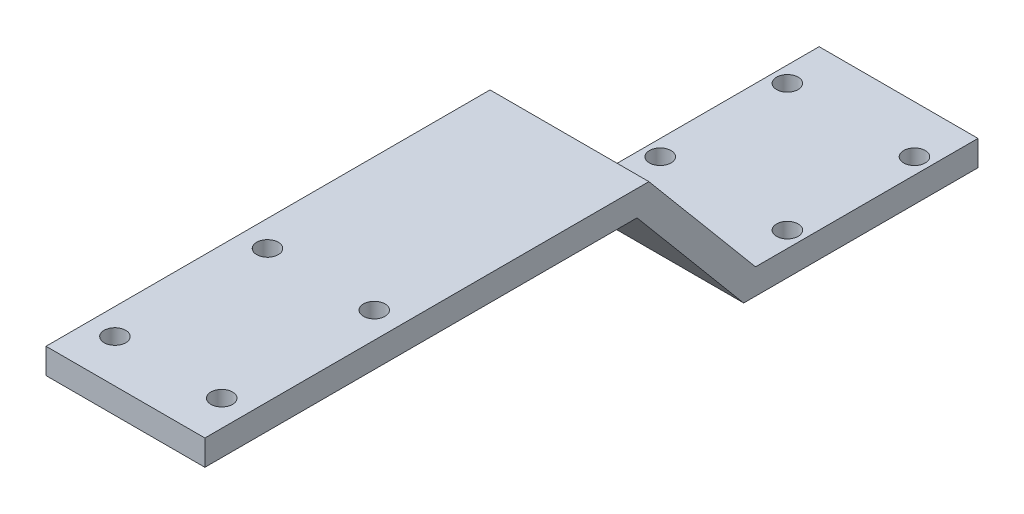
ISO-10303-21;
HEADER;
FILE_DESCRIPTION(('STEP AP214'),'2;1');
FILE_NAME('part.step','',(''),(''),'','','');
FILE_SCHEMA(('AUTOMOTIVE_DESIGN { 1 0 10303 214 1 1 1 1 }'));
ENDSEC;
DATA;
#1=APPLICATION_CONTEXT('core data for automotive mechanical design processes');
#2=APPLICATION_PROTOCOL_DEFINITION('international standard','automotive_design',2000,#1);
#3=PRODUCT_CONTEXT('',#1,'mechanical');
#4=PRODUCT('Part','Part','',(#3));
#5=PRODUCT_RELATED_PRODUCT_CATEGORY('part','',(#4));
#6=PRODUCT_DEFINITION_FORMATION('','',#4);
#7=PRODUCT_DEFINITION_CONTEXT('part definition',#1,'design');
#8=PRODUCT_DEFINITION('design','',#6,#7);
#9=PRODUCT_DEFINITION_SHAPE('','',#8);
#10=(LENGTH_UNIT() NAMED_UNIT(*) SI_UNIT(.MILLI.,.METRE.));
#11=(NAMED_UNIT(*) PLANE_ANGLE_UNIT() SI_UNIT($,.RADIAN.));
#12=(NAMED_UNIT(*) SI_UNIT($,.STERADIAN.) SOLID_ANGLE_UNIT());
#13=UNCERTAINTY_MEASURE_WITH_UNIT(LENGTH_MEASURE(1.E-05),#10,'distance_accuracy_value','');
#14=(GEOMETRIC_REPRESENTATION_CONTEXT(3) GLOBAL_UNCERTAINTY_ASSIGNED_CONTEXT((#13)) GLOBAL_UNIT_ASSIGNED_CONTEXT((#10,
#11,#12)) REPRESENTATION_CONTEXT('',''));
#15=CARTESIAN_POINT('',(0.,0.,0.));
#16=DIRECTION('',(0.,0.,1.));
#17=DIRECTION('',(1.,0.,0.));
#18=AXIS2_PLACEMENT_3D('',#15,#16,#17);
#19=CARTESIAN_POINT('',(12.5,0.,0.));
#20=DIRECTION('',(0.,1.,0.));
#21=DIRECTION('',(0.,0.,1.));
#22=AXIS2_PLACEMENT_3D('',#19,#20,#21);
#23=PLANE('',#22);
#24=CARTESIAN_POINT('',(-10.,0.,27.5));
#25=DIRECTION('',(0.,1.,0.));
#26=DIRECTION('',(0.,0.,1.));
#27=AXIS2_PLACEMENT_3D('',#24,#25,#26);
#28=CIRCLE('',#27,1.69999999999999);
#29=CARTESIAN_POINT('',(-10.,0.,29.2));
#30=VERTEX_POINT('',#29);
#31=EDGE_CURVE('E218',#30,#30,#28,.T.);
#32=ORIENTED_EDGE('',*,*,#31,.T.);
#33=EDGE_LOOP('',(#32));
#34=FACE_BOUND('',#33,.T.);
#35=CARTESIAN_POINT('',(10.,0.,27.5));
#36=DIRECTION('',(0.,1.,0.));
#37=DIRECTION('',(0.,0.,1.));
#38=AXIS2_PLACEMENT_3D('',#35,#36,#37);
#39=CIRCLE('',#38,1.69999999999999);
#40=CARTESIAN_POINT('',(10.,0.,29.2));
#41=VERTEX_POINT('',#40);
#42=EDGE_CURVE('E212',#41,#41,#39,.T.);
#43=ORIENTED_EDGE('',*,*,#42,.T.);
#44=EDGE_LOOP('',(#43));
#45=FACE_BOUND('',#44,.T.);
#46=CARTESIAN_POINT('',(10.,0.,7.5));
#47=DIRECTION('',(0.,1.,0.));
#48=DIRECTION('',(0.,0.,1.));
#49=AXIS2_PLACEMENT_3D('',#46,#47,#48);
#50=CIRCLE('',#49,1.69999999999999);
#51=CARTESIAN_POINT('',(10.,0.,9.19999999999999));
#52=VERTEX_POINT('',#51);
#53=EDGE_CURVE('E206',#52,#52,#50,.T.);
#54=ORIENTED_EDGE('',*,*,#53,.T.);
#55=EDGE_LOOP('',(#54));
#56=FACE_BOUND('',#55,.T.);
#57=CARTESIAN_POINT('',(-10.,0.,7.5));
#58=DIRECTION('',(0.,1.,0.));
#59=DIRECTION('',(0.,0.,1.));
#60=AXIS2_PLACEMENT_3D('',#57,#58,#59);
#61=CIRCLE('',#60,1.69999999999999);
#62=CARTESIAN_POINT('',(-10.,0.,9.19999999999999));
#63=VERTEX_POINT('',#62);
#64=EDGE_CURVE('E200',#63,#63,#61,.T.);
#65=ORIENTED_EDGE('',*,*,#64,.T.);
#66=EDGE_LOOP('',(#65));
#67=FACE_BOUND('',#66,.T.);
#68=DIRECTION('',(0.,0.,-1.));
#69=VECTOR('',#68,1.);
#70=CARTESIAN_POINT('',(-12.5,0.,0.));
#71=LINE('',#70,#69);
#72=CARTESIAN_POINT('',(-12.5,0.,36.86523063262));
#73=VERTEX_POINT('',#72);
#74=CARTESIAN_POINT('',(-12.5,0.,0.));
#75=VERTEX_POINT('',#74);
#76=EDGE_CURVE('E129',#73,#75,#71,.T.);
#77=ORIENTED_EDGE('',*,*,#76,.T.);
#78=DIRECTION('',(-1.,0.,0.));
#79=VECTOR('',#78,1.);
#80=CARTESIAN_POINT('',(12.5,0.,0.));
#81=LINE('',#80,#79);
#82=CARTESIAN_POINT('',(12.5,0.,0.));
#83=VERTEX_POINT('',#82);
#84=EDGE_CURVE('E11',#83,#75,#81,.T.);
#85=ORIENTED_EDGE('',*,*,#84,.F.);
#86=DIRECTION('',(0.,0.,-1.));
#87=VECTOR('',#86,1.);
#88=CARTESIAN_POINT('',(12.5,0.,0.));
#89=LINE('',#88,#87);
#90=CARTESIAN_POINT('',(12.5,0.,36.86523063262));
#91=VERTEX_POINT('',#90);
#92=EDGE_CURVE('E144',#91,#83,#89,.T.);
#93=ORIENTED_EDGE('',*,*,#92,.F.);
#94=DIRECTION('',(-1.,0.,0.));
#95=VECTOR('',#94,1.);
#96=CARTESIAN_POINT('',(12.5,0.,36.86523063262));
#97=LINE('',#96,#95);
#98=EDGE_CURVE('E125',#91,#73,#97,.T.);
#99=ORIENTED_EDGE('',*,*,#98,.T.);
#100=EDGE_LOOP('',(#77,#85,#93,#99));
#101=FACE_BOUND('',#100,.T.);
#102=ADVANCED_FACE('F33',(#34,#45,#56,#67,#101),#23,.F.);
#103=CARTESIAN_POINT('',(12.5,0.,0.));
#104=DIRECTION('',(0.,0.,1.));
#105=DIRECTION('',(1.,0.,0.));
#106=AXIS2_PLACEMENT_3D('',#103,#104,#105);
#107=PLANE('',#106);
#108=DIRECTION('',(0.,1.,0.));
#109=VECTOR('',#108,1.);
#110=CARTESIAN_POINT('',(-12.5,0.,0.));
#111=LINE('',#110,#109);
#112=CARTESIAN_POINT('',(-12.5,4.,0.));
#113=VERTEX_POINT('',#112);
#114=EDGE_CURVE('E132',#75,#113,#111,.T.);
#115=ORIENTED_EDGE('',*,*,#114,.T.);
#116=DIRECTION('',(-1.,0.,0.));
#117=VECTOR('',#116,1.);
#118=CARTESIAN_POINT('',(12.5,4.,0.));
#119=LINE('',#118,#117);
#120=CARTESIAN_POINT('',(12.5,4.,0.));
#121=VERTEX_POINT('',#120);
#122=EDGE_CURVE('E41',#121,#113,#119,.T.);
#123=ORIENTED_EDGE('',*,*,#122,.F.);
#124=DIRECTION('',(0.,1.,0.));
#125=VECTOR('',#124,1.);
#126=CARTESIAN_POINT('',(12.5,0.,0.));
#127=LINE('',#126,#125);
#128=EDGE_CURVE('E92',#83,#121,#127,.T.);
#129=ORIENTED_EDGE('',*,*,#128,.F.);
#130=ORIENTED_EDGE('',*,*,#84,.T.);
#131=EDGE_LOOP('',(#115,#123,#129,#130));
#132=FACE_BOUND('',#131,.T.);
#133=ADVANCED_FACE('F230',(#132),#107,.F.);
#134=CARTESIAN_POINT('',(12.5,4.,0.));
#135=DIRECTION('',(0.,-1.,0.));
#136=DIRECTION('',(0.,0.,-1.));
#137=AXIS2_PLACEMENT_3D('',#134,#135,#136);
#138=PLANE('',#137);
#139=CARTESIAN_POINT('',(-10.,4.,27.5));
#140=DIRECTION('',(0.,1.,0.));
#141=DIRECTION('',(0.,0.,1.));
#142=AXIS2_PLACEMENT_3D('',#139,#140,#141);
#143=CIRCLE('',#142,1.69999999999999);
#144=CARTESIAN_POINT('',(-10.,4.,29.2));
#145=VERTEX_POINT('',#144);
#146=EDGE_CURVE('E221',#145,#145,#143,.T.);
#147=ORIENTED_EDGE('',*,*,#146,.F.);
#148=EDGE_LOOP('',(#147));
#149=FACE_BOUND('',#148,.T.);
#150=CARTESIAN_POINT('',(10.,4.,27.5));
#151=DIRECTION('',(0.,1.,0.));
#152=DIRECTION('',(0.,0.,1.));
#153=AXIS2_PLACEMENT_3D('',#150,#151,#152);
#154=CIRCLE('',#153,1.69999999999999);
#155=CARTESIAN_POINT('',(10.,4.,29.2));
#156=VERTEX_POINT('',#155);
#157=EDGE_CURVE('E215',#156,#156,#154,.T.);
#158=ORIENTED_EDGE('',*,*,#157,.F.);
#159=EDGE_LOOP('',(#158));
#160=FACE_BOUND('',#159,.T.);
#161=CARTESIAN_POINT('',(10.,4.,7.5));
#162=DIRECTION('',(0.,1.,0.));
#163=DIRECTION('',(0.,0.,1.));
#164=AXIS2_PLACEMENT_3D('',#161,#162,#163);
#165=CIRCLE('',#164,1.69999999999999);
#166=CARTESIAN_POINT('',(10.,4.,9.19999999999999));
#167=VERTEX_POINT('',#166);
#168=EDGE_CURVE('E209',#167,#167,#165,.T.);
#169=ORIENTED_EDGE('',*,*,#168,.F.);
#170=EDGE_LOOP('',(#169));
#171=FACE_BOUND('',#170,.T.);
#172=CARTESIAN_POINT('',(-10.,4.,7.5));
#173=DIRECTION('',(0.,1.,0.));
#174=DIRECTION('',(0.,0.,1.));
#175=AXIS2_PLACEMENT_3D('',#172,#173,#174);
#176=CIRCLE('',#175,1.69999999999999);
#177=CARTESIAN_POINT('',(-10.,4.,9.19999999999999));
#178=VERTEX_POINT('',#177);
#179=EDGE_CURVE('E203',#178,#178,#176,.T.);
#180=ORIENTED_EDGE('',*,*,#179,.F.);
#181=EDGE_LOOP('',(#180));
#182=FACE_BOUND('',#181,.T.);
#183=DIRECTION('',(0.,0.,1.));
#184=VECTOR('',#183,1.);
#185=CARTESIAN_POINT('',(-12.5,4.,0.));
#186=LINE('',#185,#184);
#187=CARTESIAN_POINT('',(-12.5,4.,35.));
#188=VERTEX_POINT('',#187);
#189=EDGE_CURVE('E135',#113,#188,#186,.T.);
#190=ORIENTED_EDGE('',*,*,#189,.T.);
#191=DIRECTION('',(-1.,0.,0.));
#192=VECTOR('',#191,1.);
#193=CARTESIAN_POINT('',(12.5,4.,35.));
#194=LINE('',#193,#192);
#195=CARTESIAN_POINT('',(12.5,4.,35.));
#196=VERTEX_POINT('',#195);
#197=EDGE_CURVE('E151',#196,#188,#194,.T.);
#198=ORIENTED_EDGE('',*,*,#197,.F.);
#199=DIRECTION('',(0.,0.,1.));
#200=VECTOR('',#199,1.);
#201=CARTESIAN_POINT('',(12.5,4.,0.));
#202=LINE('',#201,#200);
#203=EDGE_CURVE('E159',#121,#196,#202,.T.);
#204=ORIENTED_EDGE('',*,*,#203,.F.);
#205=ORIENTED_EDGE('',*,*,#122,.T.);
#206=EDGE_LOOP('',(#190,#198,#204,#205));
#207=FACE_BOUND('',#206,.T.);
#208=ADVANCED_FACE('F157',(#149,#160,#171,#182,#207),#138,.F.);
#209=CARTESIAN_POINT('',(12.5,4.,35.));
#210=DIRECTION('',(0.,-0.642787609686538,0.766044443118979));
#211=DIRECTION('',(0.,-0.766044443118979,-0.642787609686538));
#212=AXIS2_PLACEMENT_3D('',#209,#210,#211);
#213=PLANE('',#212);
#214=DIRECTION('',(0.,0.766044443118979,0.642787609686538));
#215=VECTOR('',#214,1.);
#216=CARTESIAN_POINT('',(-12.5,4.,35.));
#217=LINE('',#216,#215);
#218=CARTESIAN_POINT('',(-12.5,24.,51.7819926235455));
#219=VERTEX_POINT('',#218);
#220=EDGE_CURVE('E137',#188,#219,#217,.T.);
#221=ORIENTED_EDGE('',*,*,#220,.T.);
#222=DIRECTION('',(-1.,0.,0.));
#223=VECTOR('',#222,1.);
#224=CARTESIAN_POINT('',(12.5,24.,51.7819926235455));
#225=LINE('',#224,#223);
#226=CARTESIAN_POINT('',(12.5,24.,51.7819926235455));
#227=VERTEX_POINT('',#226);
#228=EDGE_CURVE('E148',#227,#219,#225,.T.);
#229=ORIENTED_EDGE('',*,*,#228,.F.);
#230=DIRECTION('',(0.,0.766044443118979,0.642787609686538));
#231=VECTOR('',#230,1.);
#232=CARTESIAN_POINT('',(12.5,4.,35.));
#233=LINE('',#232,#231);
#234=EDGE_CURVE('E171',#196,#227,#233,.T.);
#235=ORIENTED_EDGE('',*,*,#234,.F.);
#236=ORIENTED_EDGE('',*,*,#197,.T.);
#237=EDGE_LOOP('',(#221,#229,#235,#236));
#238=FACE_BOUND('',#237,.T.);
#239=ADVANCED_FACE('F167',(#238),#213,.F.);
#240=CARTESIAN_POINT('',(12.5,24.,51.7819926235455));
#241=DIRECTION('',(0.,-1.,0.));
#242=DIRECTION('',(0.,0.,-1.));
#243=AXIS2_PLACEMENT_3D('',#240,#241,#242);
#244=PLANE('',#243);
#245=CARTESIAN_POINT('',(-8.4,24.,90.8972232561655));
#246=DIRECTION('',(0.,1.,0.));
#247=DIRECTION('',(0.,0.,1.));
#248=AXIS2_PLACEMENT_3D('',#245,#246,#247);
#249=CIRCLE('',#248,1.69999999999999);
#250=CARTESIAN_POINT('',(-8.4,24.,92.5972232561655));
#251=VERTEX_POINT('',#250);
#252=EDGE_CURVE('E197',#251,#251,#249,.T.);
#253=ORIENTED_EDGE('',*,*,#252,.F.);
#254=EDGE_LOOP('',(#253));
#255=FACE_BOUND('',#254,.T.);
#256=CARTESIAN_POINT('',(-8.4,24.,114.897223256166));
#257=DIRECTION('',(0.,1.,0.));
#258=DIRECTION('',(0.,0.,1.));
#259=AXIS2_PLACEMENT_3D('',#256,#257,#258);
#260=CIRCLE('',#259,1.69999999999999);
#261=CARTESIAN_POINT('',(-8.4,24.,116.597223256166));
#262=VERTEX_POINT('',#261);
#263=EDGE_CURVE('E191',#262,#262,#260,.T.);
#264=ORIENTED_EDGE('',*,*,#263,.F.);
#265=EDGE_LOOP('',(#264));
#266=FACE_BOUND('',#265,.T.);
#267=CARTESIAN_POINT('',(8.4,24.,114.897223256166));
#268=DIRECTION('',(0.,1.,0.));
#269=DIRECTION('',(0.,0.,1.));
#270=AXIS2_PLACEMENT_3D('',#267,#268,#269);
#271=CIRCLE('',#270,1.69999999999999);
#272=CARTESIAN_POINT('',(8.4,24.,116.597223256166));
#273=VERTEX_POINT('',#272);
#274=EDGE_CURVE('E185',#273,#273,#271,.T.);
#275=ORIENTED_EDGE('',*,*,#274,.F.);
#276=EDGE_LOOP('',(#275));
#277=FACE_BOUND('',#276,.T.);
#278=CARTESIAN_POINT('',(8.4,24.,90.8972232561656));
#279=DIRECTION('',(0.,1.,0.));
#280=DIRECTION('',(0.,0.,1.));
#281=AXIS2_PLACEMENT_3D('',#278,#279,#280);
#282=CIRCLE('',#281,1.69999999999999);
#283=CARTESIAN_POINT('',(8.4,24.,92.5972232561655));
#284=VERTEX_POINT('',#283);
#285=EDGE_CURVE('E179',#284,#284,#282,.T.);
#286=ORIENTED_EDGE('',*,*,#285,.F.);
#287=EDGE_LOOP('',(#286));
#288=FACE_BOUND('',#287,.T.);
#289=DIRECTION('',(0.,0.,1.));
#290=VECTOR('',#289,1.);
#291=CARTESIAN_POINT('',(-12.5,24.,51.7819926235455));
#292=LINE('',#291,#290);
#293=CARTESIAN_POINT('',(-12.5,24.,121.647223256166));
#294=VERTEX_POINT('',#293);
#295=EDGE_CURVE('E139',#219,#294,#292,.T.);
#296=ORIENTED_EDGE('',*,*,#295,.T.);
#297=DIRECTION('',(-1.,0.,0.));
#298=VECTOR('',#297,1.);
#299=CARTESIAN_POINT('',(12.5,24.,121.647223256166));
#300=LINE('',#299,#298);
#301=CARTESIAN_POINT('',(12.5,24.,121.647223256166));
#302=VERTEX_POINT('',#301);
#303=EDGE_CURVE('E120',#302,#294,#300,.T.);
#304=ORIENTED_EDGE('',*,*,#303,.F.);
#305=DIRECTION('',(0.,0.,1.));
#306=VECTOR('',#305,1.);
#307=CARTESIAN_POINT('',(12.5,24.,51.7819926235455));
#308=LINE('',#307,#306);
#309=EDGE_CURVE('E111',#227,#302,#308,.T.);
#310=ORIENTED_EDGE('',*,*,#309,.F.);
#311=ORIENTED_EDGE('',*,*,#228,.T.);
#312=EDGE_LOOP('',(#296,#304,#310,#311));
#313=FACE_BOUND('',#312,.T.);
#314=ADVANCED_FACE('F170',(#255,#266,#277,#288,#313),#244,.F.);
#315=CARTESIAN_POINT('',(12.5,24.,121.647223256166));
#316=DIRECTION('',(0.,0.,-1.));
#317=DIRECTION('',(-1.,0.,0.));
#318=AXIS2_PLACEMENT_3D('',#315,#316,#317);
#319=PLANE('',#318);
#320=DIRECTION('',(0.,-1.,0.));
#321=VECTOR('',#320,1.);
#322=CARTESIAN_POINT('',(-12.5,24.,121.647223256166));
#323=LINE('',#322,#321);
#324=CARTESIAN_POINT('',(-12.5,20.,121.647223256166));
#325=VERTEX_POINT('',#324);
#326=EDGE_CURVE('E119',#294,#325,#323,.T.);
#327=ORIENTED_EDGE('',*,*,#326,.T.);
#328=DIRECTION('',(-1.,0.,0.));
#329=VECTOR('',#328,1.);
#330=CARTESIAN_POINT('',(12.5,20.,121.647223256166));
#331=LINE('',#330,#329);
#332=CARTESIAN_POINT('',(12.5,20.,121.647223256166));
#333=VERTEX_POINT('',#332);
#334=EDGE_CURVE('E116',#333,#325,#331,.T.);
#335=ORIENTED_EDGE('',*,*,#334,.F.);
#336=DIRECTION('',(0.,-1.,0.));
#337=VECTOR('',#336,1.);
#338=CARTESIAN_POINT('',(12.5,24.,121.647223256166));
#339=LINE('',#338,#337);
#340=EDGE_CURVE('E105',#302,#333,#339,.T.);
#341=ORIENTED_EDGE('',*,*,#340,.F.);
#342=ORIENTED_EDGE('',*,*,#303,.T.);
#343=EDGE_LOOP('',(#327,#335,#341,#342));
#344=FACE_BOUND('',#343,.T.);
#345=ADVANCED_FACE('F117',(#344),#319,.F.);
#346=CARTESIAN_POINT('',(12.5,20.,53.6472232561655));
#347=DIRECTION('',(0.,1.,0.));
#348=DIRECTION('',(0.,0.,1.));
#349=AXIS2_PLACEMENT_3D('',#346,#347,#348);
#350=PLANE('',#349);
#351=CARTESIAN_POINT('',(-8.4,20.,90.8972232561655));
#352=DIRECTION('',(0.,1.,0.));
#353=DIRECTION('',(0.,0.,1.));
#354=AXIS2_PLACEMENT_3D('',#351,#352,#353);
#355=CIRCLE('',#354,1.69999999999999);
#356=CARTESIAN_POINT('',(-8.4,20.,92.5972232561655));
#357=VERTEX_POINT('',#356);
#358=EDGE_CURVE('E194',#357,#357,#355,.T.);
#359=ORIENTED_EDGE('',*,*,#358,.T.);
#360=EDGE_LOOP('',(#359));
#361=FACE_BOUND('',#360,.T.);
#362=CARTESIAN_POINT('',(-8.4,20.,114.897223256166));
#363=DIRECTION('',(0.,1.,0.));
#364=DIRECTION('',(0.,0.,1.));
#365=AXIS2_PLACEMENT_3D('',#362,#363,#364);
#366=CIRCLE('',#365,1.69999999999999);
#367=CARTESIAN_POINT('',(-8.4,20.,116.597223256166));
#368=VERTEX_POINT('',#367);
#369=EDGE_CURVE('E188',#368,#368,#366,.T.);
#370=ORIENTED_EDGE('',*,*,#369,.T.);
#371=EDGE_LOOP('',(#370));
#372=FACE_BOUND('',#371,.T.);
#373=CARTESIAN_POINT('',(8.4,20.,114.897223256166));
#374=DIRECTION('',(0.,1.,0.));
#375=DIRECTION('',(0.,0.,1.));
#376=AXIS2_PLACEMENT_3D('',#373,#374,#375);
#377=CIRCLE('',#376,1.69999999999999);
#378=CARTESIAN_POINT('',(8.4,20.,116.597223256166));
#379=VERTEX_POINT('',#378);
#380=EDGE_CURVE('E182',#379,#379,#377,.T.);
#381=ORIENTED_EDGE('',*,*,#380,.T.);
#382=EDGE_LOOP('',(#381));
#383=FACE_BOUND('',#382,.T.);
#384=CARTESIAN_POINT('',(8.4,20.,90.8972232561656));
#385=DIRECTION('',(0.,1.,0.));
#386=DIRECTION('',(0.,0.,1.));
#387=AXIS2_PLACEMENT_3D('',#384,#385,#386);
#388=CIRCLE('',#387,1.69999999999999);
#389=CARTESIAN_POINT('',(8.4,20.,92.5972232561655));
#390=VERTEX_POINT('',#389);
#391=EDGE_CURVE('E133',#390,#390,#388,.T.);
#392=ORIENTED_EDGE('',*,*,#391,.T.);
#393=EDGE_LOOP('',(#392));
#394=FACE_BOUND('',#393,.T.);
#395=DIRECTION('',(0.,0.,-1.));
#396=VECTOR('',#395,1.);
#397=CARTESIAN_POINT('',(-12.5,20.,53.6472232561655));
#398=LINE('',#397,#396);
#399=CARTESIAN_POINT('',(-12.5,20.,53.6472232561655));
#400=VERTEX_POINT('',#399);
#401=EDGE_CURVE('E78',#325,#400,#398,.T.);
#402=ORIENTED_EDGE('',*,*,#401,.T.);
#403=DIRECTION('',(-1.,0.,0.));
#404=VECTOR('',#403,1.);
#405=CARTESIAN_POINT('',(12.5,20.,53.6472232561655));
#406=LINE('',#405,#404);
#407=CARTESIAN_POINT('',(12.5,20.,53.6472232561655));
#408=VERTEX_POINT('',#407);
#409=EDGE_CURVE('E121',#408,#400,#406,.T.);
#410=ORIENTED_EDGE('',*,*,#409,.F.);
#411=DIRECTION('',(0.,0.,-1.));
#412=VECTOR('',#411,1.);
#413=CARTESIAN_POINT('',(12.5,20.,53.6472232561655));
#414=LINE('',#413,#412);
#415=EDGE_CURVE('E109',#333,#408,#414,.T.);
#416=ORIENTED_EDGE('',*,*,#415,.F.);
#417=ORIENTED_EDGE('',*,*,#334,.T.);
#418=EDGE_LOOP('',(#402,#410,#416,#417));
#419=FACE_BOUND('',#418,.T.);
#420=ADVANCED_FACE('F123',(#361,#372,#383,#394,#419),#350,.F.);
#421=CARTESIAN_POINT('',(12.5,0.,36.86523063262));
#422=DIRECTION('',(0.,0.642787609686538,-0.766044443118979));
#423=DIRECTION('',(0.,0.766044443118979,0.642787609686538));
#424=AXIS2_PLACEMENT_3D('',#421,#422,#423);
#425=PLANE('',#424);
#426=DIRECTION('',(0.,-0.766044443118979,-0.642787609686538));
#427=VECTOR('',#426,1.);
#428=CARTESIAN_POINT('',(-12.5,0.,36.86523063262));
#429=LINE('',#428,#427);
#430=EDGE_CURVE('E84',#400,#73,#429,.T.);
#431=ORIENTED_EDGE('',*,*,#430,.T.);
#432=ORIENTED_EDGE('',*,*,#98,.F.);
#433=DIRECTION('',(0.,-0.766044443118979,-0.642787609686538));
#434=VECTOR('',#433,1.);
#435=CARTESIAN_POINT('',(12.5,0.,36.86523063262));
#436=LINE('',#435,#434);
#437=EDGE_CURVE('E49',#408,#91,#436,.T.);
#438=ORIENTED_EDGE('',*,*,#437,.F.);
#439=ORIENTED_EDGE('',*,*,#409,.T.);
#440=EDGE_LOOP('',(#431,#432,#438,#439));
#441=FACE_BOUND('',#440,.T.);
#442=ADVANCED_FACE('F251',(#441),#425,.F.);
#443=CARTESIAN_POINT('',(12.5,0.,0.));
#444=DIRECTION('',(1.,0.,0.));
#445=DIRECTION('',(0.,0.,-1.));
#446=AXIS2_PLACEMENT_3D('',#443,#444,#445);
#447=PLANE('',#446);
#448=ORIENTED_EDGE('',*,*,#92,.T.);
#449=ORIENTED_EDGE('',*,*,#128,.T.);
#450=ORIENTED_EDGE('',*,*,#203,.T.);
#451=ORIENTED_EDGE('',*,*,#234,.T.);
#452=ORIENTED_EDGE('',*,*,#309,.T.);
#453=ORIENTED_EDGE('',*,*,#340,.T.);
#454=ORIENTED_EDGE('',*,*,#415,.T.);
#455=ORIENTED_EDGE('',*,*,#437,.T.);
#456=EDGE_LOOP('',(#448,#449,#450,#451,#452,#453,#454,#455));
#457=FACE_BOUND('',#456,.T.);
#458=ADVANCED_FACE('F107',(#457),#447,.T.);
#459=CARTESIAN_POINT('',(-12.5,0.,0.));
#460=DIRECTION('',(1.,0.,0.));
#461=DIRECTION('',(0.,0.,-1.));
#462=AXIS2_PLACEMENT_3D('',#459,#460,#461);
#463=PLANE('',#462);
#464=ORIENTED_EDGE('',*,*,#76,.F.);
#465=ORIENTED_EDGE('',*,*,#430,.F.);
#466=ORIENTED_EDGE('',*,*,#401,.F.);
#467=ORIENTED_EDGE('',*,*,#326,.F.);
#468=ORIENTED_EDGE('',*,*,#295,.F.);
#469=ORIENTED_EDGE('',*,*,#220,.F.);
#470=ORIENTED_EDGE('',*,*,#189,.F.);
#471=ORIENTED_EDGE('',*,*,#114,.F.);
#472=EDGE_LOOP('',(#464,#465,#466,#467,#468,#469,#470,#471));
#473=FACE_BOUND('',#472,.T.);
#474=ADVANCED_FACE('F163',(#473),#463,.F.);
#475=CARTESIAN_POINT('',(8.4,24.,90.8972232561656));
#476=DIRECTION('',(0.,1.,0.));
#477=DIRECTION('',(0.,0.,1.));
#478=AXIS2_PLACEMENT_3D('',#475,#476,#477);
#479=CYLINDRICAL_SURFACE('',#478,1.69999999999999);
#480=ORIENTED_EDGE('',*,*,#285,.T.);
#481=EDGE_LOOP('',(#480));
#482=FACE_BOUND('',#481,.T.);
#483=ORIENTED_EDGE('',*,*,#391,.F.);
#484=EDGE_LOOP('',(#483));
#485=FACE_BOUND('',#484,.T.);
#486=ADVANCED_FACE('F302',(#482,#485),#479,.F.);
#487=CARTESIAN_POINT('',(8.4,24.,114.897223256166));
#488=DIRECTION('',(0.,1.,0.));
#489=DIRECTION('',(0.,0.,1.));
#490=AXIS2_PLACEMENT_3D('',#487,#488,#489);
#491=CYLINDRICAL_SURFACE('',#490,1.69999999999999);
#492=ORIENTED_EDGE('',*,*,#274,.T.);
#493=EDGE_LOOP('',(#492));
#494=FACE_BOUND('',#493,.T.);
#495=ORIENTED_EDGE('',*,*,#380,.F.);
#496=EDGE_LOOP('',(#495));
#497=FACE_BOUND('',#496,.T.);
#498=ADVANCED_FACE('F307',(#494,#497),#491,.F.);
#499=CARTESIAN_POINT('',(-8.4,24.,114.897223256166));
#500=DIRECTION('',(0.,1.,0.));
#501=DIRECTION('',(0.,0.,1.));
#502=AXIS2_PLACEMENT_3D('',#499,#500,#501);
#503=CYLINDRICAL_SURFACE('',#502,1.69999999999999);
#504=ORIENTED_EDGE('',*,*,#263,.T.);
#505=EDGE_LOOP('',(#504));
#506=FACE_BOUND('',#505,.T.);
#507=ORIENTED_EDGE('',*,*,#369,.F.);
#508=EDGE_LOOP('',(#507));
#509=FACE_BOUND('',#508,.T.);
#510=ADVANCED_FACE('F319',(#506,#509),#503,.F.);
#511=CARTESIAN_POINT('',(-8.4,24.,90.8972232561655));
#512=DIRECTION('',(0.,1.,0.));
#513=DIRECTION('',(0.,0.,1.));
#514=AXIS2_PLACEMENT_3D('',#511,#512,#513);
#515=CYLINDRICAL_SURFACE('',#514,1.69999999999999);
#516=ORIENTED_EDGE('',*,*,#252,.T.);
#517=EDGE_LOOP('',(#516));
#518=FACE_BOUND('',#517,.T.);
#519=ORIENTED_EDGE('',*,*,#358,.F.);
#520=EDGE_LOOP('',(#519));
#521=FACE_BOUND('',#520,.T.);
#522=ADVANCED_FACE('F242',(#518,#521),#515,.F.);
#523=CARTESIAN_POINT('',(-10.,4.,7.5));
#524=DIRECTION('',(0.,1.,0.));
#525=DIRECTION('',(0.,0.,1.));
#526=AXIS2_PLACEMENT_3D('',#523,#524,#525);
#527=CYLINDRICAL_SURFACE('',#526,1.69999999999999);
#528=ORIENTED_EDGE('',*,*,#179,.T.);
#529=EDGE_LOOP('',(#528));
#530=FACE_BOUND('',#529,.T.);
#531=ORIENTED_EDGE('',*,*,#64,.F.);
#532=EDGE_LOOP('',(#531));
#533=FACE_BOUND('',#532,.T.);
#534=ADVANCED_FACE('F238',(#530,#533),#527,.F.);
#535=CARTESIAN_POINT('',(10.,4.,7.5));
#536=DIRECTION('',(0.,1.,0.));
#537=DIRECTION('',(0.,0.,1.));
#538=AXIS2_PLACEMENT_3D('',#535,#536,#537);
#539=CYLINDRICAL_SURFACE('',#538,1.69999999999999);
#540=ORIENTED_EDGE('',*,*,#168,.T.);
#541=EDGE_LOOP('',(#540));
#542=FACE_BOUND('',#541,.T.);
#543=ORIENTED_EDGE('',*,*,#53,.F.);
#544=EDGE_LOOP('',(#543));
#545=FACE_BOUND('',#544,.T.);
#546=ADVANCED_FACE('F241',(#542,#545),#539,.F.);
#547=CARTESIAN_POINT('',(10.,4.,27.5));
#548=DIRECTION('',(0.,1.,0.));
#549=DIRECTION('',(0.,0.,1.));
#550=AXIS2_PLACEMENT_3D('',#547,#548,#549);
#551=CYLINDRICAL_SURFACE('',#550,1.69999999999999);
#552=ORIENTED_EDGE('',*,*,#157,.T.);
#553=EDGE_LOOP('',(#552));
#554=FACE_BOUND('',#553,.T.);
#555=ORIENTED_EDGE('',*,*,#42,.F.);
#556=EDGE_LOOP('',(#555));
#557=FACE_BOUND('',#556,.T.);
#558=ADVANCED_FACE('F363',(#554,#557),#551,.F.);
#559=CARTESIAN_POINT('',(-10.,4.,27.5));
#560=DIRECTION('',(0.,1.,0.));
#561=DIRECTION('',(0.,0.,1.));
#562=AXIS2_PLACEMENT_3D('',#559,#560,#561);
#563=CYLINDRICAL_SURFACE('',#562,1.69999999999999);
#564=ORIENTED_EDGE('',*,*,#146,.T.);
#565=EDGE_LOOP('',(#564));
#566=FACE_BOUND('',#565,.T.);
#567=ORIENTED_EDGE('',*,*,#31,.F.);
#568=EDGE_LOOP('',(#567));
#569=FACE_BOUND('',#568,.T.);
#570=ADVANCED_FACE('F225',(#566,#569),#563,.F.);
#571=CLOSED_SHELL('',(#102,#133,#208,#239,#314,#345,#420,#442,#458,#474,#486,#498,#510,#522,
#534,#546,#558,#570));
#572=MANIFOLD_SOLID_BREP('B2',#571);
#573=ADVANCED_BREP_SHAPE_REPRESENTATION('',(#18,#572),#14);
#574=SHAPE_DEFINITION_REPRESENTATION(#9,#573);
ENDSEC;
END-ISO-10303-21;
